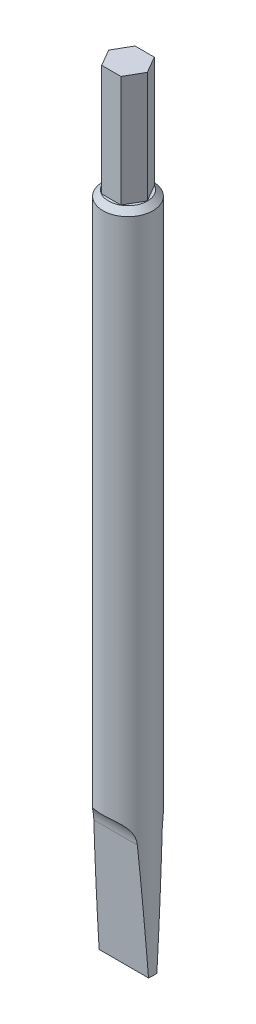
ISO-10303-21;
HEADER;
FILE_DESCRIPTION(('STEP AP214'),'2;1');
FILE_NAME('part.step','',(''),(''),'','','');
FILE_SCHEMA(('AUTOMOTIVE_DESIGN { 1 0 10303 214 1 1 1 1 }'));
ENDSEC;
DATA;
#1=APPLICATION_CONTEXT('core data for automotive mechanical design processes');
#2=APPLICATION_PROTOCOL_DEFINITION('international standard','automotive_design',2000,#1);
#3=PRODUCT_CONTEXT('',#1,'mechanical');
#4=PRODUCT('Part','Part','',(#3));
#5=PRODUCT_RELATED_PRODUCT_CATEGORY('part','',(#4));
#6=PRODUCT_DEFINITION_FORMATION('','',#4);
#7=PRODUCT_DEFINITION_CONTEXT('part definition',#1,'design');
#8=PRODUCT_DEFINITION('design','',#6,#7);
#9=PRODUCT_DEFINITION_SHAPE('','',#8);
#10=(LENGTH_UNIT() NAMED_UNIT(*) SI_UNIT(.MILLI.,.METRE.));
#11=(NAMED_UNIT(*) PLANE_ANGLE_UNIT() SI_UNIT($,.RADIAN.));
#12=(NAMED_UNIT(*) SI_UNIT($,.STERADIAN.) SOLID_ANGLE_UNIT());
#13=UNCERTAINTY_MEASURE_WITH_UNIT(LENGTH_MEASURE(1.E-05),#10,'distance_accuracy_value','');
#14=(GEOMETRIC_REPRESENTATION_CONTEXT(3) GLOBAL_UNCERTAINTY_ASSIGNED_CONTEXT((#13)) GLOBAL_UNIT_ASSIGNED_CONTEXT((#10,
#11,#12)) REPRESENTATION_CONTEXT('',''));
#15=CARTESIAN_POINT('',(0.,0.,0.));
#16=DIRECTION('',(0.,0.,1.));
#17=DIRECTION('',(1.,0.,0.));
#18=AXIS2_PLACEMENT_3D('',#15,#16,#17);
#19=CARTESIAN_POINT('',(0.,-120.,0.));
#20=DIRECTION('',(0.,1.,0.));
#21=DIRECTION('',(0.,0.,1.));
#22=AXIS2_PLACEMENT_3D('',#19,#20,#21);
#23=CYLINDRICAL_SURFACE('',#22,4.5);
#24=CARTESIAN_POINT('',(0.,-1.,0.));
#25=DIRECTION('',(0.,1.,0.));
#26=DIRECTION('',(0.,0.,1.));
#27=AXIS2_PLACEMENT_3D('',#24,#25,#26);
#28=CIRCLE('',#27,4.5);
#29=CARTESIAN_POINT('',(0.,-1.,4.5));
#30=VERTEX_POINT('',#29);
#31=EDGE_CURVE('E11',#30,#30,#28,.F.);
#32=ORIENTED_EDGE('',*,*,#31,.T.);
#33=EDGE_LOOP('',(#32));
#34=FACE_BOUND('',#33,.T.);
#35=CARTESIAN_POINT('',(0.,-103.394913822876,-4.5));
#36=CARTESIAN_POINT('',(-0.103069362665923,-103.394914042659,-4.49999959992725));
#37=CARTESIAN_POINT('',(-0.206146526435712,-103.39262561122,-4.4964547687701));
#38=CARTESIAN_POINT('',(-0.411646375812206,-103.383423224018,-4.48231641289706));
#39=CARTESIAN_POINT('',(-0.514068786670953,-103.37650744061,-4.471720103098));
#40=CARTESIAN_POINT('',(-0.717671951158927,-103.35789552238,-4.44359339520637));
#41=CARTESIAN_POINT('',(-0.818850709741653,-103.346192534688,-4.42605305791932));
#42=CARTESIAN_POINT('',(-1.01914825963944,-103.317776455429,-4.38426815019585));
#43=CARTESIAN_POINT('',(-1.11826612333105,-103.301061157844,-4.36002062815834));
#44=CARTESIAN_POINT('',(-1.31380152114607,-103.262306170916,-4.30514220860287));
#45=CARTESIAN_POINT('',(-1.41021536260285,-103.240259561821,-4.27450302221004));
#46=CARTESIAN_POINT('',(-1.59943155048247,-103.190529876519,-4.20736148164584));
#47=CARTESIAN_POINT('',(-1.69223560424762,-103.162849504525,-4.17086194222075));
#48=CARTESIAN_POINT('',(-1.87350490130666,-103.101518436916,-4.09264183349527));
#49=CARTESIAN_POINT('',(-1.96197270731233,-103.067871323284,-4.05092440102979));
#50=CARTESIAN_POINT('',(-2.13393666412592,-102.994279950018,-3.96303382328752));
#51=CARTESIAN_POINT('',(-2.21743303962978,-102.954335975283,-3.91686087963601));
#52=CARTESIAN_POINT('',(-2.37646391449524,-102.869174718413,-3.82239737029962));
#53=CARTESIAN_POINT('',(-2.45216008078263,-102.824146396459,-3.77420859180666));
#54=CARTESIAN_POINT('',(-2.59782907350368,-102.727787089095,-3.67546318239439));
#55=CARTESIAN_POINT('',(-2.66779991646167,-102.67645393472,-3.62490574033656));
#56=CARTESIAN_POINT('',(-2.80159661560524,-102.567531137201,-3.52252047999784));
#57=CARTESIAN_POINT('',(-2.8654256400608,-102.509944752788,-3.47069333419625));
#58=CARTESIAN_POINT('',(-2.98679509415646,-102.388614781465,-3.36681443417587));
#59=CARTESIAN_POINT('',(-3.04433320149471,-102.324868937029,-3.31476260433588));
#60=CARTESIAN_POINT('',(-3.15104312227083,-102.193974436802,-3.21343160285213));
#61=CARTESIAN_POINT('',(-3.20044482157964,-102.12703718801,-3.16412086929093));
#62=CARTESIAN_POINT('',(-3.29344984525705,-101.988055624931,-3.0671977760816));
#63=CARTESIAN_POINT('',(-3.33705110482004,-101.916009505936,-3.01958602561714));
#64=CARTESIAN_POINT('',(-3.4186310570823,-101.767266878692,-2.92690525303494));
#65=CARTESIAN_POINT('',(-3.45661023014175,-101.690570768537,-2.88183601388481));
#66=CARTESIAN_POINT('',(-3.52724775030431,-101.53297296321,-2.79493487388618));
#67=CARTESIAN_POINT('',(-3.55990413285861,-101.452069729729,-2.75310417130193));
#68=CARTESIAN_POINT('',(-3.6219367440911,-101.28186560832,-2.67102432402597));
#69=CARTESIAN_POINT('',(-3.65101984206152,-101.19234891593,-2.63100129171947));
#70=CARTESIAN_POINT('',(-3.70403304904539,-101.009771882005,-2.55582789107762));
#71=CARTESIAN_POINT('',(-3.72796092597583,-100.916710025943,-2.52067963573703));
#72=CARTESIAN_POINT('',(-3.77106708250034,-100.727657709272,-2.45572257370377));
#73=CARTESIAN_POINT('',(-3.79024470528684,-100.631666845735,-2.42591450554497));
#74=CARTESIAN_POINT('',(-3.82422567164936,-100.437339866016,-2.37198512656201));
#75=CARTESIAN_POINT('',(-3.83902866120985,-100.339003560726,-2.34786427600567));
#76=CARTESIAN_POINT('',(-3.86602211295916,-100.129353034472,-2.30317872247504));
#77=CARTESIAN_POINT('',(-3.87773008241694,-100.017825268037,-2.28332122951141));
#78=CARTESIAN_POINT('',(-3.89646653880564,-99.7932914657791,-2.25119824829118));
#79=CARTESIAN_POINT('',(-3.90349471231479,-99.6802853314612,-2.23893326853475));
#80=CARTESIAN_POINT('',(-3.91308600686779,-99.4534613843335,-2.22212780064841));
#81=CARTESIAN_POINT('',(-3.91564714529122,-99.3396432336147,-2.21759074245095));
#82=CARTESIAN_POINT('',(-3.91637773677079,-99.1119495796707,-2.21629990204797));
#83=CARTESIAN_POINT('',(-3.91454713883189,-98.998074075795,-2.21954621021972));
#84=CARTESIAN_POINT('',(-3.90616454068512,-98.7633117297481,-2.23426894804854));
#85=CARTESIAN_POINT('',(-3.89930286209515,-98.6424692075514,-2.24628494335067));
#86=CARTESIAN_POINT('',(-3.88027386542345,-98.402379038641,-2.2789980246609));
#87=CARTESIAN_POINT('',(-3.86810624825723,-98.2831314822228,-2.29969560002873));
#88=CARTESIAN_POINT('',(-3.83805987169652,-98.0471146765915,-2.34949827973738));
#89=CARTESIAN_POINT('',(-3.82018035463176,-97.9303457583566,-2.37860449941632));
#90=CARTESIAN_POINT('',(-3.77816410484998,-97.700240844913,-2.44479279662184));
#91=CARTESIAN_POINT('',(-3.75402763285338,-97.5869047068837,-2.48187454180608));
#92=CARTESIAN_POINT('',(-3.69934686071029,-97.3666734464334,-2.56264818514399));
#93=CARTESIAN_POINT('',(-3.66892797534512,-97.2596983870466,-2.60620662438003));
#94=CARTESIAN_POINT('',(-3.6007534422785,-97.0509444606988,-2.69961396127203));
#95=CARTESIAN_POINT('',(-3.56299779241061,-96.9491655952721,-2.74946286078548));
#96=CARTESIAN_POINT('',(-3.47953864440164,-96.7518689054786,-2.85434660668727));
#97=CARTESIAN_POINT('',(-3.43384376500395,-96.6563444446521,-2.90937580002357));
#98=CARTESIAN_POINT('',(-3.3339258219214,-96.4723551385887,-3.02335500686728));
#99=CARTESIAN_POINT('',(-3.2797039909588,-96.3838892756883,-3.08230445292271));
#100=CARTESIAN_POINT('',(-3.16847855957584,-96.2236046087848,-3.19631152006897));
#101=CARTESIAN_POINT('',(-3.11235065569653,-96.1510113485991,-3.25113633589682));
#102=CARTESIAN_POINT('',(-2.99288250161539,-96.0125695106199,-3.36143714975015));
#103=CARTESIAN_POINT('',(-2.92954292203082,-95.9467203067733,-3.41691308679795));
#104=CARTESIAN_POINT('',(-2.79578912411174,-95.8220714125837,-3.52719038039944));
#105=CARTESIAN_POINT('',(-2.72537706555112,-95.763269582091,-3.58199193718975));
#106=CARTESIAN_POINT('',(-2.57778204696871,-95.652802975382,-3.68963122609969));
#107=CARTESIAN_POINT('',(-2.50059939899424,-95.601137870526,-3.74246904856555));
#108=CARTESIAN_POINT('',(-2.34717040047751,-95.5091957964646,-3.84035365857383));
#109=CARTESIAN_POINT('',(-2.27146003882035,-95.4683131853461,-3.88567430027106));
#110=CARTESIAN_POINT('',(-2.11529480833383,-95.3922359565951,-3.972848583273));
#111=CARTESIAN_POINT('',(-2.03483843928944,-95.3570431508055,-4.0147011181452));
#112=CARTESIAN_POINT('',(-1.86976491901818,-95.2921376723537,-4.09418737623395));
#113=CARTESIAN_POINT('',(-1.78514852365474,-95.2624240087761,-4.13182186181072));
#114=CARTESIAN_POINT('',(-1.61229273576319,-95.2081830224124,-4.20228834208165));
#115=CARTESIAN_POINT('',(-1.5240519687402,-95.1836576893278,-4.23511849285271));
#116=CARTESIAN_POINT('',(-1.34297373485952,-95.1391247663095,-4.29601076944073));
#117=CARTESIAN_POINT('',(-1.25008227473877,-95.119205847982,-4.32397708815631));
#118=CARTESIAN_POINT('',(-1.06180899916159,-95.0841653046433,-4.37402031006423));
#119=CARTESIAN_POINT('',(-0.966426342269643,-95.0690453238235,-4.39609519434713));
#120=CARTESIAN_POINT('',(-0.773829999084719,-95.0433649599258,-4.43405247530582));
#121=CARTESIAN_POINT('',(-0.67661623380171,-95.0328047740197,-4.44993460419531));
#122=CARTESIAN_POINT('',(-0.480984528317148,-95.0160579191887,-4.47530827628885));
#123=CARTESIAN_POINT('',(-0.382566543780501,-95.009871411783,-4.48479958348028));
#124=CARTESIAN_POINT('',(-0.179786485951478,-95.0015365778041,-4.49761588849471));
#125=CARTESIAN_POINT('',(-0.0753915311064896,-94.9996254651257,-4.50057852937734));
#126=CARTESIAN_POINT('',(0.133298519520404,-95.0004951178538,-4.49923517876634));
#127=CARTESIAN_POINT('',(0.237593636135419,-95.0032744409985,-4.49493142161667));
#128=CARTESIAN_POINT('',(0.445460657929832,-95.0135840572233,-4.47911096934641));
#129=CARTESIAN_POINT('',(0.549032116626808,-95.021117059519,-4.46759016111325));
#130=CARTESIAN_POINT('',(0.754625845668836,-95.0410874084281,-4.43749130505876));
#131=CARTESIAN_POINT('',(0.856648700766109,-95.0535228534982,-4.41891599361709));
#132=CARTESIAN_POINT('',(1.05994525916555,-95.0837602785431,-4.37464243756219));
#133=CARTESIAN_POINT('',(1.16118558801717,-95.1016388796568,-4.34884294710629));
#134=CARTESIAN_POINT('',(1.36053785732147,-95.143007132598,-4.29065419495021));
#135=CARTESIAN_POINT('',(1.45865101676466,-95.1664945669813,-4.2582675382252));
#136=CARTESIAN_POINT('',(1.65098719675716,-95.2194423919957,-4.18745032243508));
#137=CARTESIAN_POINT('',(1.74521105913875,-95.2489014818249,-4.14902108003093));
#138=CARTESIAN_POINT('',(1.92901767855518,-95.3141635141516,-4.06681991059837));
#139=CARTESIAN_POINT('',(2.01860068178547,-95.3499661196823,-4.02304826739616));
#140=CARTESIAN_POINT('',(2.18891848545426,-95.4266740694932,-3.93288020236327));
#141=CARTESIAN_POINT('',(2.26986393495041,-95.4673177649192,-3.88665900252031));
#142=CARTESIAN_POINT('',(2.42626213602189,-95.5549803520153,-3.79099688495645));
#143=CARTESIAN_POINT('',(2.50171301535398,-95.6020014012547,-3.74155488053635));
#144=CARTESIAN_POINT('',(2.64656035017944,-95.7024681214229,-3.64053705577675));
#145=CARTESIAN_POINT('',(2.7159614560591,-95.7559087811697,-3.58896292015322));
#146=CARTESIAN_POINT('',(2.84846407594613,-95.8692271728094,-3.48473261347847));
#147=CARTESIAN_POINT('',(2.91156332549746,-95.9291072026348,-3.43207606161792));
#148=CARTESIAN_POINT('',(3.02840560019249,-96.0520982713688,-3.32934266894438));
#149=CARTESIAN_POINT('',(3.08245105089512,-96.1149197416817,-3.27926236791103));
#150=CARTESIAN_POINT('',(3.18465150256467,-96.2459623576306,-3.18010490670167));
#151=CARTESIAN_POINT('',(3.23280441410219,-96.3141854045644,-3.13102810746448));
#152=CARTESIAN_POINT('',(3.32330769017291,-96.4556291794089,-3.03479657993719));
#153=CARTESIAN_POINT('',(3.36565874341878,-96.5288493125892,-2.98764162398132));
#154=CARTESIAN_POINT('',(3.44480286097594,-96.6798778646987,-2.89603178121556));
#155=CARTESIAN_POINT('',(3.48159386714152,-96.7576879679373,-2.85157789787664));
#156=CARTESIAN_POINT('',(3.55117195899449,-96.9203591953555,-2.76448915105963));
#157=CARTESIAN_POINT('',(3.58375903483153,-97.0053749690322,-2.7219835871284));
#158=CARTESIAN_POINT('',(3.64365535207883,-97.1792604539376,-2.64126927684474));
#159=CARTESIAN_POINT('',(3.67096233171437,-97.2681317968632,-2.60306237477839));
#160=CARTESIAN_POINT('',(3.72068770710745,-97.4491359280304,-2.53147847510344));
#161=CARTESIAN_POINT('',(3.74310552182694,-97.5412691024041,-2.49810205171688));
#162=CARTESIAN_POINT('',(3.78343773102366,-97.7282323184802,-2.43658605030679));
#163=CARTESIAN_POINT('',(3.80135173551187,-97.8230625929362,-2.40844692584048));
#164=CARTESIAN_POINT('',(3.83477673953591,-98.0254867373075,-2.35490834516224));
#165=CARTESIAN_POINT('',(3.84980292215984,-98.1333323737528,-2.33015598307192));
#166=CARTESIAN_POINT('',(3.87512687895666,-98.350964521976,-2.28779373167278));
#167=CARTESIAN_POINT('',(3.88542435170483,-98.4607511570169,-2.27018429768784));
#168=CARTESIAN_POINT('',(3.90158383710491,-98.6816216375678,-2.24229877350844));
#169=CARTESIAN_POINT('',(3.90744396683313,-98.7927060134766,-2.23202579654068));
#170=CARTESIAN_POINT('',(3.91489365328982,-99.0154551962105,-2.21893299425261));
#171=CARTESIAN_POINT('',(3.91648310020706,-99.1271200178865,-2.21611336057868));
#172=CARTESIAN_POINT('',(3.91539728764432,-99.359443697774,-2.21803256126057));
#173=CARTESIAN_POINT('',(3.9123651171464,-99.4800963396136,-2.22340397701381));
#174=CARTESIAN_POINT('',(3.90125936585219,-99.7204736261698,-2.24283296683402));
#175=CARTESIAN_POINT('',(3.89318547551112,-99.8401982134499,-2.25689107423434));
#176=CARTESIAN_POINT('',(3.87171813877961,-100.077894459356,-2.29352339709322));
#177=CARTESIAN_POINT('',(3.85832316253481,-100.195865603725,-2.3161000616107));
#178=CARTESIAN_POINT('',(3.82578291934211,-100.429130513122,-2.36946433582886));
#179=CARTESIAN_POINT('',(3.80663778801869,-100.54442434123,-2.40025175186696));
#180=CARTESIAN_POINT('',(3.76204969756655,-100.771324533996,-2.46955006626094));
#181=CARTESIAN_POINT('',(3.73661164235411,-100.882933693623,-2.50805494617879));
#182=CARTESIAN_POINT('',(3.67876997677129,-101.10159785216,-2.59215244599267));
#183=CARTESIAN_POINT('',(3.64636625414008,-101.208652777638,-2.63774518011545));
#184=CARTESIAN_POINT('',(3.57392775310543,-101.417121358701,-2.73508968205905));
#185=CARTESIAN_POINT('',(3.53389992732547,-101.518540046106,-2.78683582239652));
#186=CARTESIAN_POINT('',(3.4455351808607,-101.714850708547,-2.89537198598166));
#187=CARTESIAN_POINT('',(3.39719938041741,-101.80974356111,-2.9521613287091));
#188=CARTESIAN_POINT('',(3.29650209378132,-101.983775221334,-3.06401792825744));
#189=CARTESIAN_POINT('',(3.24490917812633,-102.063561604967,-3.11877030223412));
#190=CARTESIAN_POINT('',(3.13418199914556,-102.216403021385,-3.23002452467416));
#191=CARTESIAN_POINT('',(3.07504820853484,-102.289458475617,-3.28652626330706));
#192=CARTESIAN_POINT('',(2.94923741426076,-102.428344036006,-3.39987656193094));
#193=CARTESIAN_POINT('',(2.8825653978878,-102.494178863178,-3.45672486934677));
#194=CARTESIAN_POINT('',(2.74182760560054,-102.618409132379,-3.56938382220597));
#195=CARTESIAN_POINT('',(2.66776238592768,-102.676805133331,-3.62519454533972));
#196=CARTESIAN_POINT('',(2.52073395305747,-102.780391407808,-3.72868896674217));
#197=CARTESIAN_POINT('',(2.44846069234197,-102.826323719211,-3.77661337954485));
#198=CARTESIAN_POINT('',(2.29869197722838,-102.912266607234,-3.86959754692028));
#199=CARTESIAN_POINT('',(2.22119473433098,-102.952275140632,-3.91465631003366));
#200=CARTESIAN_POINT('',(2.0614928938653,-103.026537112772,-4.00106138832015));
#201=CARTESIAN_POINT('',(1.97928722568457,-103.060789235588,-4.04240685362277));
#202=CARTESIAN_POINT('',(1.81072524154588,-103.123790491803,-4.1206688840926));
#203=CARTESIAN_POINT('',(1.72436743323571,-103.152537627834,-4.15758383993657));
#204=CARTESIAN_POINT('',(1.54817364969426,-103.204791578248,-4.22635764730017));
#205=CARTESIAN_POINT('',(1.45833913474396,-103.228300565307,-4.25821859353252));
#206=CARTESIAN_POINT('',(1.27573849578302,-103.270397304679,-4.3164428873989));
#207=CARTESIAN_POINT('',(1.18297107780909,-103.288982849931,-4.34280376836452));
#208=CARTESIAN_POINT('',(0.995331853000642,-103.321462475154,-4.38960691636663));
#209=CARTESIAN_POINT('',(0.900464034630363,-103.335364749555,-4.41005951223732));
#210=CARTESIAN_POINT('',(0.709077330364519,-103.358749809845,-4.44484740959923));
#211=CARTESIAN_POINT('',(0.612558468930338,-103.368232661153,-4.4591828016397));
#212=CARTESIAN_POINT('',(0.430138417632378,-103.382060878757,-4.48021987851915));
#213=CARTESIAN_POINT('',(0.34435431572488,-103.38688649476,-4.48763162485991));
#214=CARTESIAN_POINT('',(0.172381964724902,-103.393312896669,-4.49752188615395));
#215=CARTESIAN_POINT('',(0.0861937101970529,-103.394913639079,-4.50000033456842));
#216=CARTESIAN_POINT('',(0.,-103.394913822876,-4.5));
#217=B_SPLINE_CURVE_WITH_KNOTS('',3,(#35,#36,#37,#38,#39,#40,#41,#42,#43,#44,#45,#46,#47,#48,
#49,#50,#51,#52,#53,#54,#55,#56,#57,#58,#59,#60,#61,#62,#63,#64,#65,#66,#67,#68,#69,#70,#71,#72,
#73,#74,#75,#76,#77,#78,#79,#80,#81,#82,#83,#84,#85,#86,#87,#88,#89,#90,#91,#92,#93,#94,#95,#96,
#97,#98,#99,#100,#101,#102,#103,#104,#105,#106,#107,#108,#109,#110,#111,#112,#113,#114,#115,
#116,#117,#118,#119,#120,#121,#122,#123,#124,#125,#126,#127,#128,#129,#130,#131,#132,#133,#134,
#135,#136,#137,#138,#139,#140,#141,#142,#143,#144,#145,#146,#147,#148,#149,#150,#151,#152,#153,
#154,#155,#156,#157,#158,#159,#160,#161,#162,#163,#164,#165,#166,#167,#168,#169,#170,#171,#172,
#173,#174,#175,#176,#177,#178,#179,#180,#181,#182,#183,#184,#185,#186,#187,#188,#189,#190,#191,
#192,#193,#194,#195,#196,#197,#198,#199,#200,#201,#202,#203,#204,#205,#206,#207,#208,#209,#210,
#211,#212,#213,#214,#215,#216),.UNSPECIFIED.,.T.,.F.,(4,2,2,2,2,2,2,2,2,2,2,2,2,2,2,2,2,2,2,2,2,
2,2,2,2,2,2,2,2,2,2,2,2,2,2,2,2,2,2,2,2,2,2,2,2,2,2,2,2,2,2,2,2,2,2,2,2,2,2,2,2,2,2,2,2,2,2,2,2,
2,2,2,2,2,2,2,2,2,2,2,2,2,2,2,2,2,2,2,2,2,4),(0.,0.309135188173823,0.618392546272531,
0.928094163427287,1.23793228701997,1.54817474269632,1.85826863124843,2.1681769890218,
2.47807132908082,2.77887922218733,3.07979088952104,3.38054648928678,3.68141274123979,
3.97121245448042,4.26111505440179,4.55099287026077,4.84097743386243,5.14749365790799,
5.45414233035835,5.76083337883225,6.06754923936998,6.4088342372236,6.75014208978927,
7.09160138774854,7.43306465061265,7.79752512639501,8.16200614869649,8.5265355386486,
8.89104974150324,9.24888991183937,9.60673018784064,9.96418439614746,10.3215869755264,
10.6418214865778,10.9620262431482,11.2821335120663,11.602226035416,11.893632150727,
12.1851308784472,12.4765768361295,12.7681343602163,13.0649078374311,13.3617828844209,
13.6586707674181,13.9555696138638,14.2685711441521,14.5814764471602,14.8945602423359,
15.2075227188972,15.5251120490117,15.842576027905,16.1599709279819,16.4773489731259,
16.7820217341375,17.0867978295394,17.3913375424989,17.6959862954218,17.9861303984156,
18.2763770870127,18.5665892918134,18.856908661828,19.1580344208093,19.4592888852297,
19.7605791318424,20.0618954584726,20.396533300421,20.7311924704109,21.0659935688243,
21.4008032758306,21.7628096678089,22.1248382879575,22.4869710696219,22.84909531061,
23.2109382414062,23.5727870042114,23.9343073537812,24.2957789943862,24.6243013724941,
24.9528031666232,25.2810888818575,25.6093499164933,25.903392228367,26.1975357258831,
26.4917463740058,26.7860635688321,27.0802584587959,27.3745850069726,27.6683938572329,
27.9621983582687,28.2207150382292,28.4792352049594),.UNSPECIFIED.);
#218=CARTESIAN_POINT('',(-3.90913794443017,-98.8486745427176,-2.22904475760722));
#219=VERTEX_POINT('',#218);
#220=CARTESIAN_POINT('',(3.90913794443017,-98.8486745427176,-2.22904475760722));
#221=VERTEX_POINT('',#220);
#222=EDGE_CURVE('E132',#219,#221,#217,.T.);
#223=ORIENTED_EDGE('',*,*,#222,.F.);
#224=CARTESIAN_POINT('',(0.,-130.725499692535,0.));
#225=DIRECTION('',(0.,-0.0697564737441183,-0.997564050259825));
#226=DIRECTION('',(0.,0.997564050259825,-0.0697564737441183));
#227=AXIS2_PLACEMENT_3D('',#224,#225,#226);
#228=ELLIPSE('',#227,64.510141617923,4.5);
#229=CARTESIAN_POINT('',(-4.43705983732471,-120.,-0.750000000000003));
#230=VERTEX_POINT('',#229);
#231=EDGE_CURVE('E148',#219,#230,#228,.F.);
#232=ORIENTED_EDGE('',*,*,#231,.T.);
#233=CARTESIAN_POINT('',(0.,-120.,0.));
#234=DIRECTION('',(0.,1.,0.));
#235=DIRECTION('',(0.,0.,1.));
#236=AXIS2_PLACEMENT_3D('',#233,#234,#235);
#237=CIRCLE('',#236,4.5);
#238=CARTESIAN_POINT('',(-4.43705983732471,-120.,0.749999999999999));
#239=VERTEX_POINT('',#238);
#240=EDGE_CURVE('E143',#230,#239,#237,.T.);
#241=ORIENTED_EDGE('',*,*,#240,.T.);
#242=CARTESIAN_POINT('',(0.,-130.725499692535,0.));
#243=DIRECTION('',(0.,0.0697564737441183,-0.997564050259825));
#244=DIRECTION('',(0.,0.997564050259825,0.0697564737441183));
#245=AXIS2_PLACEMENT_3D('',#242,#243,#244);
#246=ELLIPSE('',#245,64.510141617923,4.5);
#247=CARTESIAN_POINT('',(-3.90913794443017,-98.8486745427176,2.22904475760722));
#248=VERTEX_POINT('',#247);
#249=EDGE_CURVE('E62',#248,#239,#246,.F.);
#250=ORIENTED_EDGE('',*,*,#249,.F.);
#251=CARTESIAN_POINT('',(0.,-103.394913822876,4.5));
#252=CARTESIAN_POINT('',(-0.103069362665923,-103.394914042659,4.49999959992725));
#253=CARTESIAN_POINT('',(-0.206146526435712,-103.39262561122,4.4964547687701));
#254=CARTESIAN_POINT('',(-0.411646375812205,-103.383423224018,4.48231641289706));
#255=CARTESIAN_POINT('',(-0.514068786670951,-103.37650744061,4.471720103098));
#256=CARTESIAN_POINT('',(-0.717671951158924,-103.35789552238,4.44359339520637));
#257=CARTESIAN_POINT('',(-0.818850709741651,-103.346192534688,4.42605305791933));
#258=CARTESIAN_POINT('',(-1.01914825963943,-103.317776455429,4.38426815019585));
#259=CARTESIAN_POINT('',(-1.11826612333105,-103.301061157844,4.36002062815834));
#260=CARTESIAN_POINT('',(-1.31380152114607,-103.262306170916,4.30514220860287));
#261=CARTESIAN_POINT('',(-1.41021536260285,-103.240259561821,4.27450302221004));
#262=CARTESIAN_POINT('',(-1.59943155048248,-103.190529876519,4.20736148164584));
#263=CARTESIAN_POINT('',(-1.69223560424763,-103.162849504525,4.17086194222075));
#264=CARTESIAN_POINT('',(-1.87350490130667,-103.101518436916,4.09264183349527));
#265=CARTESIAN_POINT('',(-1.96197270731234,-103.067871323284,4.05092440102978));
#266=CARTESIAN_POINT('',(-2.13393666412593,-102.994279950018,3.96303382328751));
#267=CARTESIAN_POINT('',(-2.21743303962979,-102.954335975283,3.91686087963601));
#268=CARTESIAN_POINT('',(-2.37646391449524,-102.869174718413,3.82239737029962));
#269=CARTESIAN_POINT('',(-2.45216008078264,-102.824146396459,3.77420859180666));
#270=CARTESIAN_POINT('',(-2.59782907350368,-102.727787089095,3.67546318239439));
#271=CARTESIAN_POINT('',(-2.66779991646167,-102.67645393472,3.62490574033656));
#272=CARTESIAN_POINT('',(-2.80159661560525,-102.567531137201,3.52252047999784));
#273=CARTESIAN_POINT('',(-2.86542564006081,-102.509944752788,3.47069333419624));
#274=CARTESIAN_POINT('',(-2.98679509415646,-102.388614781465,3.36681443417587));
#275=CARTESIAN_POINT('',(-3.04433320149472,-102.324868937029,3.31476260433588));
#276=CARTESIAN_POINT('',(-3.15104312227083,-102.193974436802,3.21343160285213));
#277=CARTESIAN_POINT('',(-3.20044482157964,-102.12703718801,3.16412086929093));
#278=CARTESIAN_POINT('',(-3.29344984525705,-101.988055624931,3.0671977760816));
#279=CARTESIAN_POINT('',(-3.33705110482005,-101.916009505936,3.01958602561713));
#280=CARTESIAN_POINT('',(-3.41863105708231,-101.767266878692,2.92690525303494));
#281=CARTESIAN_POINT('',(-3.45661023014175,-101.690570768537,2.8818360138848));
#282=CARTESIAN_POINT('',(-3.52724775030431,-101.53297296321,2.79493487388617));
#283=CARTESIAN_POINT('',(-3.55990413285861,-101.452069729729,2.75310417130193));
#284=CARTESIAN_POINT('',(-3.62193674409111,-101.28186560832,2.67102432402596));
#285=CARTESIAN_POINT('',(-3.65101984206153,-101.19234891593,2.63100129171946));
#286=CARTESIAN_POINT('',(-3.7040330490454,-101.009771882005,2.55582789107761));
#287=CARTESIAN_POINT('',(-3.72796092597584,-100.916710025943,2.52067963573702));
#288=CARTESIAN_POINT('',(-3.77106708250035,-100.727657709272,2.45572257370377));
#289=CARTESIAN_POINT('',(-3.79024470528685,-100.631666845735,2.42591450554496));
#290=CARTESIAN_POINT('',(-3.82422567164936,-100.437339866016,2.371985126562));
#291=CARTESIAN_POINT('',(-3.83902866120985,-100.339003560726,2.34786427600567));
#292=CARTESIAN_POINT('',(-3.86602211295916,-100.129353034472,2.30317872247504));
#293=CARTESIAN_POINT('',(-3.87773008241695,-100.017825268037,2.2833212295114));
#294=CARTESIAN_POINT('',(-3.89646653880564,-99.7932914657791,2.25119824829117));
#295=CARTESIAN_POINT('',(-3.90349471231479,-99.6802853314612,2.23893326853474));
#296=CARTESIAN_POINT('',(-3.91308600686779,-99.4534613843335,2.2221278006484));
#297=CARTESIAN_POINT('',(-3.91564714529122,-99.3396432336147,2.21759074245094));
#298=CARTESIAN_POINT('',(-3.9163777367708,-99.1119495796707,2.21629990204796));
#299=CARTESIAN_POINT('',(-3.9145471388319,-98.998074075795,2.21954621021972));
#300=CARTESIAN_POINT('',(-3.90616454068512,-98.7633117297481,2.23426894804853));
#301=CARTESIAN_POINT('',(-3.89930286209515,-98.6424692075514,2.24628494335066));
#302=CARTESIAN_POINT('',(-3.88027386542346,-98.402379038641,2.2789980246609));
#303=CARTESIAN_POINT('',(-3.86810624825724,-98.2831314822228,2.29969560002872));
#304=CARTESIAN_POINT('',(-3.83805987169653,-98.0471146765915,2.34949827973737));
#305=CARTESIAN_POINT('',(-3.82018035463177,-97.9303457583566,2.37860449941632));
#306=CARTESIAN_POINT('',(-3.77816410484999,-97.700240844913,2.44479279662183));
#307=CARTESIAN_POINT('',(-3.75402763285339,-97.5869047068837,2.48187454180607));
#308=CARTESIAN_POINT('',(-3.6993468607103,-97.3666734464334,2.56264818514399));
#309=CARTESIAN_POINT('',(-3.66892797534513,-97.2596983870466,2.60620662438002));
#310=CARTESIAN_POINT('',(-3.60075344227851,-97.0509444606988,2.69961396127203));
#311=CARTESIAN_POINT('',(-3.56299779241062,-96.9491655952721,2.74946286078547));
#312=CARTESIAN_POINT('',(-3.47953864440165,-96.7518689054786,2.85434660668726));
#313=CARTESIAN_POINT('',(-3.43384376500395,-96.6563444446521,2.90937580002356));
#314=CARTESIAN_POINT('',(-3.3339258219214,-96.4723551385887,3.02335500686727));
#315=CARTESIAN_POINT('',(-3.27970399095881,-96.3838892756883,3.0823044529227));
#316=CARTESIAN_POINT('',(-3.16847855957585,-96.2236046087848,3.19631152006896));
#317=CARTESIAN_POINT('',(-3.11235065569654,-96.1510113485991,3.25113633589682));
#318=CARTESIAN_POINT('',(-2.99288250161539,-96.0125695106199,3.36143714975015));
#319=CARTESIAN_POINT('',(-2.92954292203082,-95.9467203067733,3.41691308679795));
#320=CARTESIAN_POINT('',(-2.79578912411174,-95.8220714125837,3.52719038039944));
#321=CARTESIAN_POINT('',(-2.72537706555113,-95.763269582091,3.58199193718975));
#322=CARTESIAN_POINT('',(-2.57778204696872,-95.652802975382,3.68963122609968));
#323=CARTESIAN_POINT('',(-2.50059939899425,-95.601137870526,3.74246904856555));
#324=CARTESIAN_POINT('',(-2.34717040047752,-95.5091957964646,3.84035365857382));
#325=CARTESIAN_POINT('',(-2.27146003882036,-95.4683131853461,3.88567430027106));
#326=CARTESIAN_POINT('',(-2.11529480833384,-95.3922359565951,3.97284858327299));
#327=CARTESIAN_POINT('',(-2.03483843928945,-95.3570431508055,4.01470111814519));
#328=CARTESIAN_POINT('',(-1.86976491901819,-95.2921376723537,4.09418737623394));
#329=CARTESIAN_POINT('',(-1.78514852365475,-95.2624240087761,4.13182186181072));
#330=CARTESIAN_POINT('',(-1.6122927357632,-95.2081830224124,4.20228834208165));
#331=CARTESIAN_POINT('',(-1.52405196874021,-95.1836576893278,4.23511849285271));
#332=CARTESIAN_POINT('',(-1.34297373485953,-95.1391247663095,4.29601076944073));
#333=CARTESIAN_POINT('',(-1.25008227473878,-95.119205847982,4.32397708815631));
#334=CARTESIAN_POINT('',(-1.0618089991616,-95.0841653046433,4.37402031006423));
#335=CARTESIAN_POINT('',(-0.966426342269648,-95.0690453238235,4.39609519434713));
#336=CARTESIAN_POINT('',(-0.773829999084723,-95.0433649599258,4.43405247530582));
#337=CARTESIAN_POINT('',(-0.676616233801715,-95.0328047740197,4.44993460419531));
#338=CARTESIAN_POINT('',(-0.480984528317152,-95.0160579191887,4.47530827628885));
#339=CARTESIAN_POINT('',(-0.382566543780504,-95.009871411783,4.48479958348028));
#340=CARTESIAN_POINT('',(-0.179786485951481,-95.0015365778041,4.49761588849471));
#341=CARTESIAN_POINT('',(-0.0753915311064939,-94.9996254651257,4.50057852937734));
#342=CARTESIAN_POINT('',(0.133298519520399,-95.0004951178538,4.49923517876634));
#343=CARTESIAN_POINT('',(0.237593636135414,-95.0032744409985,4.49493142161667));
#344=CARTESIAN_POINT('',(0.445460657929827,-95.0135840572233,4.47911096934641));
#345=CARTESIAN_POINT('',(0.549032116626802,-95.021117059519,4.46759016111325));
#346=CARTESIAN_POINT('',(0.75462584566883,-95.0410874084281,4.43749130505876));
#347=CARTESIAN_POINT('',(0.856648700766104,-95.0535228534981,4.41891599361709));
#348=CARTESIAN_POINT('',(1.05994525916554,-95.0837602785431,4.37464243756219));
#349=CARTESIAN_POINT('',(1.16118558801716,-95.1016388796568,4.34884294710629));
#350=CARTESIAN_POINT('',(1.36053785732146,-95.143007132598,4.29065419495021));
#351=CARTESIAN_POINT('',(1.45865101676466,-95.1664945669813,4.2582675382252));
#352=CARTESIAN_POINT('',(1.65098719675716,-95.2194423919957,4.18745032243508));
#353=CARTESIAN_POINT('',(1.74521105913875,-95.2489014818249,4.14902108003093));
#354=CARTESIAN_POINT('',(1.92901767855518,-95.3141635141516,4.06681991059837));
#355=CARTESIAN_POINT('',(2.01860068178547,-95.3499661196823,4.02304826739616));
#356=CARTESIAN_POINT('',(2.18891848545425,-95.4266740694932,3.93288020236327));
#357=CARTESIAN_POINT('',(2.26986393495041,-95.4673177649192,3.88665900252031));
#358=CARTESIAN_POINT('',(2.4262621360219,-95.5549803520153,3.79099688495645));
#359=CARTESIAN_POINT('',(2.50171301535399,-95.6020014012547,3.74155488053635));
#360=CARTESIAN_POINT('',(2.64656035017944,-95.7024681214229,3.64053705577675));
#361=CARTESIAN_POINT('',(2.7159614560591,-95.7559087811697,3.58896292015322));
#362=CARTESIAN_POINT('',(2.84846407594613,-95.8692271728094,3.48473261347847));
#363=CARTESIAN_POINT('',(2.91156332549746,-95.9291072026347,3.43207606161792));
#364=CARTESIAN_POINT('',(3.02840560019249,-96.0520982713688,3.32934266894438));
#365=CARTESIAN_POINT('',(3.08245105089513,-96.1149197416817,3.27926236791102));
#366=CARTESIAN_POINT('',(3.18465150256468,-96.2459623576306,3.18010490670166));
#367=CARTESIAN_POINT('',(3.23280441410219,-96.3141854045644,3.13102810746447));
#368=CARTESIAN_POINT('',(3.32330769017292,-96.4556291794089,3.03479657993718));
#369=CARTESIAN_POINT('',(3.36565874341879,-96.5288493125892,2.98764162398131));
#370=CARTESIAN_POINT('',(3.44480286097594,-96.6798778646987,2.89603178121556));
#371=CARTESIAN_POINT('',(3.48159386714152,-96.7576879679373,2.85157789787664));
#372=CARTESIAN_POINT('',(3.55117195899449,-96.9203591953555,2.76448915105963));
#373=CARTESIAN_POINT('',(3.58375903483153,-97.0053749690322,2.7219835871284));
#374=CARTESIAN_POINT('',(3.64365535207883,-97.1792604539376,2.64126927684473));
#375=CARTESIAN_POINT('',(3.67096233171438,-97.2681317968632,2.60306237477838));
#376=CARTESIAN_POINT('',(3.72068770710746,-97.4491359280304,2.53147847510343));
#377=CARTESIAN_POINT('',(3.74310552182694,-97.5412691024041,2.49810205171687));
#378=CARTESIAN_POINT('',(3.78343773102366,-97.7282323184802,2.43658605030678));
#379=CARTESIAN_POINT('',(3.80135173551188,-97.8230625929362,2.40844692584047));
#380=CARTESIAN_POINT('',(3.83477673953591,-98.0254867373075,2.35490834516223));
#381=CARTESIAN_POINT('',(3.84980292215984,-98.1333323737528,2.33015598307192));
#382=CARTESIAN_POINT('',(3.87512687895667,-98.350964521976,2.28779373167278));
#383=CARTESIAN_POINT('',(3.88542435170484,-98.4607511570169,2.27018429768784));
#384=CARTESIAN_POINT('',(3.90158383710492,-98.6816216375678,2.24229877350844));
#385=CARTESIAN_POINT('',(3.90744396683314,-98.7927060134766,2.23202579654068));
#386=CARTESIAN_POINT('',(3.91489365328983,-99.0154551962105,2.2189329942526));
#387=CARTESIAN_POINT('',(3.91648310020707,-99.1271200178865,2.21611336057867));
#388=CARTESIAN_POINT('',(3.91539728764433,-99.359443697774,2.21803256126056));
#389=CARTESIAN_POINT('',(3.9123651171464,-99.4800963396136,2.2234039770138));
#390=CARTESIAN_POINT('',(3.90125936585219,-99.7204736261697,2.24283296683402));
#391=CARTESIAN_POINT('',(3.89318547551113,-99.8401982134499,2.25689107423433));
#392=CARTESIAN_POINT('',(3.87171813877961,-100.077894459356,2.29352339709321));
#393=CARTESIAN_POINT('',(3.85832316253482,-100.195865603725,2.31610006161069));
#394=CARTESIAN_POINT('',(3.82578291934212,-100.429130513122,2.36946433582886));
#395=CARTESIAN_POINT('',(3.80663778801869,-100.54442434123,2.40025175186695));
#396=CARTESIAN_POINT('',(3.76204969756656,-100.771324533996,2.46955006626093));
#397=CARTESIAN_POINT('',(3.73661164235412,-100.882933693623,2.50805494617878));
#398=CARTESIAN_POINT('',(3.6787699767713,-101.10159785216,2.59215244599266));
#399=CARTESIAN_POINT('',(3.64636625414009,-101.208652777638,2.63774518011544));
#400=CARTESIAN_POINT('',(3.57392775310544,-101.417121358701,2.73508968205904));
#401=CARTESIAN_POINT('',(3.53389992732547,-101.518540046106,2.78683582239651));
#402=CARTESIAN_POINT('',(3.4455351808607,-101.714850708547,2.89537198598165));
#403=CARTESIAN_POINT('',(3.39719938041741,-101.80974356111,2.95216132870909));
#404=CARTESIAN_POINT('',(3.29650209378133,-101.983775221334,3.06401792825743));
#405=CARTESIAN_POINT('',(3.24490917812634,-102.063561604967,3.11877030223411));
#406=CARTESIAN_POINT('',(3.13418199914556,-102.216403021385,3.23002452467415));
#407=CARTESIAN_POINT('',(3.07504820853485,-102.289458475617,3.28652626330706));
#408=CARTESIAN_POINT('',(2.94923741426076,-102.428344036006,3.39987656193094));
#409=CARTESIAN_POINT('',(2.88256539788781,-102.494178863178,3.45672486934676));
#410=CARTESIAN_POINT('',(2.74182760560055,-102.618409132379,3.56938382220596));
#411=CARTESIAN_POINT('',(2.66776238592769,-102.676805133331,3.62519454533971));
#412=CARTESIAN_POINT('',(2.52073395305748,-102.780391407808,3.72868896674217));
#413=CARTESIAN_POINT('',(2.44846069234198,-102.826323719211,3.77661337954484));
#414=CARTESIAN_POINT('',(2.29869197722839,-102.912266607234,3.86959754692028));
#415=CARTESIAN_POINT('',(2.22119473433099,-102.952275140632,3.91465631003365));
#416=CARTESIAN_POINT('',(2.06149289386531,-103.026537112772,4.00106138832014));
#417=CARTESIAN_POINT('',(1.97928722568458,-103.060789235588,4.04240685362276));
#418=CARTESIAN_POINT('',(1.81072524154588,-103.123790491803,4.1206688840926));
#419=CARTESIAN_POINT('',(1.72436743323572,-103.152537627834,4.15758383993656));
#420=CARTESIAN_POINT('',(1.54817364969426,-103.204791578248,4.22635764730017));
#421=CARTESIAN_POINT('',(1.45833913474397,-103.228300565307,4.25821859353252));
#422=CARTESIAN_POINT('',(1.27573849578302,-103.270397304679,4.3164428873989));
#423=CARTESIAN_POINT('',(1.18297107780909,-103.288982849931,4.34280376836452));
#424=CARTESIAN_POINT('',(0.995331853000643,-103.321462475154,4.38960691636663));
#425=CARTESIAN_POINT('',(0.900464034630363,-103.335364749555,4.41005951223732));
#426=CARTESIAN_POINT('',(0.709077330364519,-103.358749809845,4.44484740959923));
#427=CARTESIAN_POINT('',(0.612558468930339,-103.368232661153,4.4591828016397));
#428=CARTESIAN_POINT('',(0.43013841763238,-103.382060878757,4.48021987851915));
#429=CARTESIAN_POINT('',(0.344354315724881,-103.38688649476,4.48763162485991));
#430=CARTESIAN_POINT('',(0.172381964724903,-103.393312896669,4.49752188615395));
#431=CARTESIAN_POINT('',(0.0861937101970533,-103.394913639079,4.50000033456842));
#432=CARTESIAN_POINT('',(0.,-103.394913822876,4.5));
#433=B_SPLINE_CURVE_WITH_KNOTS('',3,(#251,#252,#253,#254,#255,#256,#257,#258,#259,#260,#261,
#262,#263,#264,#265,#266,#267,#268,#269,#270,#271,#272,#273,#274,#275,#276,#277,#278,#279,#280,
#281,#282,#283,#284,#285,#286,#287,#288,#289,#290,#291,#292,#293,#294,#295,#296,#297,#298,#299,
#300,#301,#302,#303,#304,#305,#306,#307,#308,#309,#310,#311,#312,#313,#314,#315,#316,#317,#318,
#319,#320,#321,#322,#323,#324,#325,#326,#327,#328,#329,#330,#331,#332,#333,#334,#335,#336,#337,
#338,#339,#340,#341,#342,#343,#344,#345,#346,#347,#348,#349,#350,#351,#352,#353,#354,#355,#356,
#357,#358,#359,#360,#361,#362,#363,#364,#365,#366,#367,#368,#369,#370,#371,#372,#373,#374,#375,
#376,#377,#378,#379,#380,#381,#382,#383,#384,#385,#386,#387,#388,#389,#390,#391,#392,#393,#394,
#395,#396,#397,#398,#399,#400,#401,#402,#403,#404,#405,#406,#407,#408,#409,#410,#411,#412,#413,
#414,#415,#416,#417,#418,#419,#420,#421,#422,#423,#424,#425,#426,#427,#428,#429,#430,#431,#432),
.UNSPECIFIED.,.T.,.F.,(4,2,2,2,2,2,2,2,2,2,2,2,2,2,2,2,2,2,2,2,2,2,2,2,2,2,2,2,2,2,2,2,2,2,2,2,
2,2,2,2,2,2,2,2,2,2,2,2,2,2,2,2,2,2,2,2,2,2,2,2,2,2,2,2,2,2,2,2,2,2,2,2,2,2,2,2,2,2,2,2,2,2,2,2,
2,2,2,2,2,2,4),(0.,0.309135188173822,0.618392546272529,0.928094163427283,1.23793228701997,
1.54817474269632,1.85826863124844,2.16817698902182,2.47807132908082,2.77887922218734,
3.07979088952104,3.38054648928678,3.6814127412398,3.97121245448041,4.2611150544018,
4.55099287026078,4.84097743386244,5.14749365790802,5.45414233035836,5.76083337883228,
6.06754923937,6.40883423722361,6.75014208978929,7.09160138774855,7.43306465061267,
7.79752512639503,8.16200614869651,8.52653553864862,8.89104974150326,9.24888991183939,
9.60673018784065,9.96418439614747,10.3215869755264,10.6418214865779,10.9620262431482,
11.2821335120663,11.6022260354161,11.893632150727,12.1851308784472,12.4765768361295,
12.7681343602163,13.0649078374311,13.3617828844209,13.6586707674181,13.9555696138638,
14.2685711441521,14.5814764471602,14.8945602423359,15.2075227188972,15.5251120490117,
15.842576027905,16.159970927982,16.4773489731259,16.7820217341375,17.0867978295395,
17.3913375424989,17.6959862954218,17.9861303984156,18.2763770870127,18.5665892918135,
18.856908661828,19.1580344208093,19.4592888852298,19.7605791318424,20.0618954584726,
20.3965333004211,20.7311924704109,21.0659935688243,21.4008032758306,21.7628096678089,
22.1248382879576,22.4869710696219,22.84909531061,23.2109382414062,23.5727870042114,
23.9343073537813,24.2957789943863,24.6243013724941,24.9528031666232,25.2810888818576,
25.6093499164933,25.903392228367,26.1975357258831,26.4917463740058,26.7860635688322,
27.080258458796,27.3745850069726,27.6683938572329,27.9621983582687,28.2207150382293,
28.4792352049594),.UNSPECIFIED.);
#434=CARTESIAN_POINT('',(3.90913794443017,-98.8486745427176,2.22904475760722));
#435=VERTEX_POINT('',#434);
#436=EDGE_CURVE('E126',#248,#435,#433,.T.);
#437=ORIENTED_EDGE('',*,*,#436,.T.);
#438=CARTESIAN_POINT('',(4.43705983732471,-120.,0.749999999999997));
#439=VERTEX_POINT('',#438);
#440=EDGE_CURVE('E136',#439,#435,#246,.F.);
#441=ORIENTED_EDGE('',*,*,#440,.F.);
#442=CARTESIAN_POINT('',(4.43705983732471,-120.,-0.750000000000004));
#443=VERTEX_POINT('',#442);
#444=EDGE_CURVE('E154',#439,#443,#237,.T.);
#445=ORIENTED_EDGE('',*,*,#444,.T.);
#446=EDGE_CURVE('E70',#443,#221,#228,.F.);
#447=ORIENTED_EDGE('',*,*,#446,.T.);
#448=EDGE_LOOP('',(#223,#232,#241,#250,#437,#441,#445,#447));
#449=FACE_BOUND('',#448,.T.);
#450=ADVANCED_FACE('F45',(#34,#449),#23,.T.);
#451=CARTESIAN_POINT('',(0.,-120.,0.));
#452=DIRECTION('',(0.,1.,0.));
#453=DIRECTION('',(0.,0.,1.));
#454=AXIS2_PLACEMENT_3D('',#451,#452,#453);
#455=PLANE('',#454);
#456=DIRECTION('',(-1.,0.,0.));
#457=VECTOR('',#456,1.);
#458=CARTESIAN_POINT('',(0.,-120.,-0.750000000000004));
#459=LINE('',#458,#457);
#460=EDGE_CURVE('E133',#443,#230,#459,.T.);
#461=ORIENTED_EDGE('',*,*,#460,.F.);
#462=ORIENTED_EDGE('',*,*,#444,.F.);
#463=DIRECTION('',(-1.,0.,0.));
#464=VECTOR('',#463,1.);
#465=CARTESIAN_POINT('',(0.,-120.,0.749999999999999));
#466=LINE('',#465,#464);
#467=EDGE_CURVE('E222',#439,#239,#466,.T.);
#468=ORIENTED_EDGE('',*,*,#467,.T.);
#469=ORIENTED_EDGE('',*,*,#240,.F.);
#470=EDGE_LOOP('',(#461,#462,#468,#469));
#471=FACE_BOUND('',#470,.T.);
#472=ADVANCED_FACE('F244',(#471),#455,.F.);
#473=CARTESIAN_POINT('',(3.46410161513775,20.,0.));
#474=DIRECTION('',(-0.866025403784438,0.,0.5));
#475=DIRECTION('',(0.5,0.,0.866025403784438));
#476=AXIS2_PLACEMENT_3D('',#473,#474,#475);
#477=PLANE('',#476);
#478=DIRECTION('',(-0.5,0.,-0.866025403784438));
#479=VECTOR('',#478,1.);
#480=CARTESIAN_POINT('',(3.46410161513775,0.,0.));
#481=LINE('',#480,#479);
#482=CARTESIAN_POINT('',(3.46410161513775,0.,0.));
#483=VERTEX_POINT('',#482);
#484=CARTESIAN_POINT('',(1.73205080756888,0.,-3.));
#485=VERTEX_POINT('',#484);
#486=EDGE_CURVE('E176',#483,#485,#481,.T.);
#487=ORIENTED_EDGE('',*,*,#486,.T.);
#488=DIRECTION('',(0.,-1.,0.));
#489=VECTOR('',#488,1.);
#490=CARTESIAN_POINT('',(1.73205080756888,20.,-3.));
#491=LINE('',#490,#489);
#492=CARTESIAN_POINT('',(1.73205080756888,20.,-3.));
#493=VERTEX_POINT('',#492);
#494=EDGE_CURVE('E218',#493,#485,#491,.T.);
#495=ORIENTED_EDGE('',*,*,#494,.F.);
#496=DIRECTION('',(-0.5,0.,-0.866025403784438));
#497=VECTOR('',#496,1.);
#498=CARTESIAN_POINT('',(3.46410161513775,20.,0.));
#499=LINE('',#498,#497);
#500=CARTESIAN_POINT('',(3.46410161513775,20.,0.));
#501=VERTEX_POINT('',#500);
#502=EDGE_CURVE('E155',#501,#493,#499,.T.);
#503=ORIENTED_EDGE('',*,*,#502,.F.);
#504=DIRECTION('',(0.,-1.,0.));
#505=VECTOR('',#504,1.);
#506=CARTESIAN_POINT('',(3.46410161513775,20.,0.));
#507=LINE('',#506,#505);
#508=EDGE_CURVE('E175',#501,#483,#507,.T.);
#509=ORIENTED_EDGE('',*,*,#508,.T.);
#510=EDGE_LOOP('',(#487,#495,#503,#509));
#511=FACE_BOUND('',#510,.T.);
#512=ADVANCED_FACE('F246',(#511),#477,.F.);
#513=CARTESIAN_POINT('',(1.73205080756888,20.,-3.));
#514=DIRECTION('',(0.,0.,1.));
#515=DIRECTION('',(1.,0.,0.));
#516=AXIS2_PLACEMENT_3D('',#513,#514,#515);
#517=PLANE('',#516);
#518=DIRECTION('',(-1.,0.,0.));
#519=VECTOR('',#518,1.);
#520=CARTESIAN_POINT('',(1.73205080756888,0.,-3.));
#521=LINE('',#520,#519);
#522=CARTESIAN_POINT('',(-1.73205080756888,0.,-3.));
#523=VERTEX_POINT('',#522);
#524=EDGE_CURVE('E180',#485,#523,#521,.T.);
#525=ORIENTED_EDGE('',*,*,#524,.T.);
#526=DIRECTION('',(0.,-1.,0.));
#527=VECTOR('',#526,1.);
#528=CARTESIAN_POINT('',(-1.73205080756888,20.,-3.));
#529=LINE('',#528,#527);
#530=CARTESIAN_POINT('',(-1.73205080756888,20.,-3.));
#531=VERTEX_POINT('',#530);
#532=EDGE_CURVE('E214',#531,#523,#529,.T.);
#533=ORIENTED_EDGE('',*,*,#532,.F.);
#534=DIRECTION('',(-1.,0.,0.));
#535=VECTOR('',#534,1.);
#536=CARTESIAN_POINT('',(1.73205080756888,20.,-3.));
#537=LINE('',#536,#535);
#538=EDGE_CURVE('E159',#493,#531,#537,.T.);
#539=ORIENTED_EDGE('',*,*,#538,.F.);
#540=ORIENTED_EDGE('',*,*,#494,.T.);
#541=EDGE_LOOP('',(#525,#533,#539,#540));
#542=FACE_BOUND('',#541,.T.);
#543=ADVANCED_FACE('F346',(#542),#517,.F.);
#544=CARTESIAN_POINT('',(-1.73205080756888,20.,-3.));
#545=DIRECTION('',(0.866025403784439,0.,0.5));
#546=DIRECTION('',(0.5,0.,-0.866025403784439));
#547=AXIS2_PLACEMENT_3D('',#544,#545,#546);
#548=PLANE('',#547);
#549=DIRECTION('',(-0.5,0.,0.866025403784439));
#550=VECTOR('',#549,1.);
#551=CARTESIAN_POINT('',(-1.73205080756888,0.,-3.));
#552=LINE('',#551,#550);
#553=CARTESIAN_POINT('',(-3.46410161513775,0.,0.));
#554=VERTEX_POINT('',#553);
#555=EDGE_CURVE('E184',#523,#554,#552,.T.);
#556=ORIENTED_EDGE('',*,*,#555,.T.);
#557=DIRECTION('',(0.,-1.,0.));
#558=VECTOR('',#557,1.);
#559=CARTESIAN_POINT('',(-3.46410161513775,20.,0.));
#560=LINE('',#559,#558);
#561=CARTESIAN_POINT('',(-3.46410161513775,20.,0.));
#562=VERTEX_POINT('',#561);
#563=EDGE_CURVE('E210',#562,#554,#560,.T.);
#564=ORIENTED_EDGE('',*,*,#563,.F.);
#565=DIRECTION('',(-0.5,0.,0.866025403784439));
#566=VECTOR('',#565,1.);
#567=CARTESIAN_POINT('',(-1.73205080756888,20.,-3.));
#568=LINE('',#567,#566);
#569=EDGE_CURVE('E163',#531,#562,#568,.T.);
#570=ORIENTED_EDGE('',*,*,#569,.F.);
#571=ORIENTED_EDGE('',*,*,#532,.T.);
#572=EDGE_LOOP('',(#556,#564,#570,#571));
#573=FACE_BOUND('',#572,.T.);
#574=ADVANCED_FACE('F335',(#573),#548,.F.);
#575=CARTESIAN_POINT('',(-3.46410161513775,20.,0.));
#576=DIRECTION('',(0.866025403784439,0.,-0.5));
#577=DIRECTION('',(-0.5,0.,-0.866025403784439));
#578=AXIS2_PLACEMENT_3D('',#575,#576,#577);
#579=PLANE('',#578);
#580=DIRECTION('',(0.5,0.,0.866025403784439));
#581=VECTOR('',#580,1.);
#582=CARTESIAN_POINT('',(-3.46410161513775,0.,0.));
#583=LINE('',#582,#581);
#584=CARTESIAN_POINT('',(-1.73205080756888,0.,3.));
#585=VERTEX_POINT('',#584);
#586=EDGE_CURVE('E188',#554,#585,#583,.T.);
#587=ORIENTED_EDGE('',*,*,#586,.T.);
#588=DIRECTION('',(0.,-1.,0.));
#589=VECTOR('',#588,1.);
#590=CARTESIAN_POINT('',(-1.73205080756888,20.,3.));
#591=LINE('',#590,#589);
#592=CARTESIAN_POINT('',(-1.73205080756888,20.,3.));
#593=VERTEX_POINT('',#592);
#594=EDGE_CURVE('E206',#593,#585,#591,.T.);
#595=ORIENTED_EDGE('',*,*,#594,.F.);
#596=DIRECTION('',(0.5,0.,0.866025403784439));
#597=VECTOR('',#596,1.);
#598=CARTESIAN_POINT('',(-3.46410161513775,20.,0.));
#599=LINE('',#598,#597);
#600=EDGE_CURVE('E166',#562,#593,#599,.T.);
#601=ORIENTED_EDGE('',*,*,#600,.F.);
#602=ORIENTED_EDGE('',*,*,#563,.T.);
#603=EDGE_LOOP('',(#587,#595,#601,#602));
#604=FACE_BOUND('',#603,.T.);
#605=ADVANCED_FACE('F324',(#604),#579,.F.);
#606=CARTESIAN_POINT('',(-1.73205080756888,20.,3.));
#607=DIRECTION('',(0.,0.,-1.));
#608=DIRECTION('',(-1.,0.,0.));
#609=AXIS2_PLACEMENT_3D('',#606,#607,#608);
#610=PLANE('',#609);
#611=DIRECTION('',(1.,0.,0.));
#612=VECTOR('',#611,1.);
#613=CARTESIAN_POINT('',(-1.73205080756888,0.,3.));
#614=LINE('',#613,#612);
#615=CARTESIAN_POINT('',(1.73205080756888,0.,3.));
#616=VERTEX_POINT('',#615);
#617=EDGE_CURVE('E192',#585,#616,#614,.T.);
#618=ORIENTED_EDGE('',*,*,#617,.T.);
#619=DIRECTION('',(0.,-1.,0.));
#620=VECTOR('',#619,1.);
#621=CARTESIAN_POINT('',(1.73205080756888,20.,3.));
#622=LINE('',#621,#620);
#623=CARTESIAN_POINT('',(1.73205080756888,20.,3.));
#624=VERTEX_POINT('',#623);
#625=EDGE_CURVE('E202',#624,#616,#622,.T.);
#626=ORIENTED_EDGE('',*,*,#625,.F.);
#627=DIRECTION('',(1.,0.,0.));
#628=VECTOR('',#627,1.);
#629=CARTESIAN_POINT('',(-1.73205080756888,20.,3.));
#630=LINE('',#629,#628);
#631=EDGE_CURVE('E169',#593,#624,#630,.T.);
#632=ORIENTED_EDGE('',*,*,#631,.F.);
#633=ORIENTED_EDGE('',*,*,#594,.T.);
#634=EDGE_LOOP('',(#618,#626,#632,#633));
#635=FACE_BOUND('',#634,.T.);
#636=ADVANCED_FACE('F312',(#635),#610,.F.);
#637=CARTESIAN_POINT('',(1.73205080756888,20.,3.));
#638=DIRECTION('',(-0.866025403784438,0.,-0.5));
#639=DIRECTION('',(-0.5,0.,0.866025403784439));
#640=AXIS2_PLACEMENT_3D('',#637,#638,#639);
#641=PLANE('',#640);
#642=DIRECTION('',(0.5,0.,-0.866025403784438));
#643=VECTOR('',#642,1.);
#644=CARTESIAN_POINT('',(1.73205080756888,0.,3.));
#645=LINE('',#644,#643);
#646=EDGE_CURVE('E160',#616,#483,#645,.T.);
#647=ORIENTED_EDGE('',*,*,#646,.T.);
#648=ORIENTED_EDGE('',*,*,#508,.F.);
#649=DIRECTION('',(0.5,0.,-0.866025403784438));
#650=VECTOR('',#649,1.);
#651=CARTESIAN_POINT('',(1.73205080756888,20.,3.));
#652=LINE('',#651,#650);
#653=EDGE_CURVE('E172',#624,#501,#652,.T.);
#654=ORIENTED_EDGE('',*,*,#653,.F.);
#655=ORIENTED_EDGE('',*,*,#625,.T.);
#656=EDGE_LOOP('',(#647,#648,#654,#655));
#657=FACE_BOUND('',#656,.T.);
#658=ADVANCED_FACE('F254',(#657),#641,.F.);
#659=CARTESIAN_POINT('',(0.,20.,0.));
#660=DIRECTION('',(0.,1.,0.));
#661=DIRECTION('',(0.,0.,1.));
#662=AXIS2_PLACEMENT_3D('',#659,#660,#661);
#663=PLANE('',#662);
#664=ORIENTED_EDGE('',*,*,#502,.T.);
#665=ORIENTED_EDGE('',*,*,#538,.T.);
#666=ORIENTED_EDGE('',*,*,#569,.T.);
#667=ORIENTED_EDGE('',*,*,#600,.T.);
#668=ORIENTED_EDGE('',*,*,#631,.T.);
#669=ORIENTED_EDGE('',*,*,#653,.T.);
#670=EDGE_LOOP('',(#664,#665,#666,#667,#668,#669));
#671=FACE_BOUND('',#670,.T.);
#672=ADVANCED_FACE('F249',(#671),#663,.T.);
#673=CARTESIAN_POINT('',(0.,0.,0.));
#674=DIRECTION('',(0.,1.,0.));
#675=DIRECTION('',(0.,0.,1.));
#676=AXIS2_PLACEMENT_3D('',#673,#674,#675);
#677=PLANE('',#676);
#678=CARTESIAN_POINT('',(0.,0.,0.));
#679=DIRECTION('',(0.,1.,0.));
#680=DIRECTION('',(0.,0.,1.));
#681=AXIS2_PLACEMENT_3D('',#678,#679,#680);
#682=CIRCLE('',#681,3.5);
#683=CARTESIAN_POINT('',(0.,0.,3.5));
#684=VERTEX_POINT('',#683);
#685=EDGE_CURVE('E55',#684,#684,#682,.T.);
#686=ORIENTED_EDGE('',*,*,#685,.T.);
#687=EDGE_LOOP('',(#686));
#688=FACE_BOUND('',#687,.T.);
#689=ORIENTED_EDGE('',*,*,#486,.F.);
#690=ORIENTED_EDGE('',*,*,#646,.F.);
#691=ORIENTED_EDGE('',*,*,#617,.F.);
#692=ORIENTED_EDGE('',*,*,#586,.F.);
#693=ORIENTED_EDGE('',*,*,#555,.F.);
#694=ORIENTED_EDGE('',*,*,#524,.F.);
#695=EDGE_LOOP('',(#689,#690,#691,#692,#693,#694));
#696=FACE_BOUND('',#695,.T.);
#697=ADVANCED_FACE('F243',(#688,#696),#677,.T.);
#698=CARTESIAN_POINT('',(-4.5,-99.1974569114382,7.21686500890634));
#699=DIRECTION('',(1.,0.,0.));
#700=DIRECTION('',(0.,0.,-1.));
#701=AXIS2_PLACEMENT_3D('',#698,#699,#700);
#702=CYLINDRICAL_SURFACE('',#701,5.);
#703=DIRECTION('',(1.,0.,0.));
#704=VECTOR('',#703,1.);
#705=CARTESIAN_POINT('',(-4.5,-98.8486745427176,2.22904475760722));
#706=LINE('',#705,#704);
#707=EDGE_CURVE('E128',#248,#435,#706,.T.);
#708=ORIENTED_EDGE('',*,*,#707,.T.);
#709=ORIENTED_EDGE('',*,*,#436,.F.);
#710=EDGE_LOOP('',(#708,#709));
#711=FACE_BOUND('',#710,.T.);
#712=ADVANCED_FACE('F127',(#711),#702,.F.);
#713=CARTESIAN_POINT('',(-4.5,-0.636105788365684,9.09673658338119));
#714=DIRECTION('',(0.,0.0697564737441183,-0.997564050259825));
#715=DIRECTION('',(0.,0.997564050259825,0.0697564737441183));
#716=AXIS2_PLACEMENT_3D('',#713,#714,#715);
#717=PLANE('',#716);
#718=ORIENTED_EDGE('',*,*,#249,.T.);
#719=ORIENTED_EDGE('',*,*,#467,.F.);
#720=ORIENTED_EDGE('',*,*,#440,.T.);
#721=ORIENTED_EDGE('',*,*,#707,.F.);
#722=EDGE_LOOP('',(#718,#719,#720,#721));
#723=FACE_BOUND('',#722,.T.);
#724=ADVANCED_FACE('F135',(#723),#717,.F.);
#725=CARTESIAN_POINT('',(-4.5,-0.636105788365684,-9.09673658338119));
#726=DIRECTION('',(0.,-0.0697564737441183,-0.997564050259825));
#727=DIRECTION('',(0.,0.997564050259825,-0.0697564737441183));
#728=AXIS2_PLACEMENT_3D('',#725,#726,#727);
#729=PLANE('',#728);
#730=DIRECTION('',(1.,0.,0.));
#731=VECTOR('',#730,1.);
#732=CARTESIAN_POINT('',(-4.5,-98.8486745427176,-2.22904475760722));
#733=LINE('',#732,#731);
#734=EDGE_CURVE('E138',#219,#221,#733,.T.);
#735=ORIENTED_EDGE('',*,*,#734,.T.);
#736=ORIENTED_EDGE('',*,*,#446,.F.);
#737=ORIENTED_EDGE('',*,*,#460,.T.);
#738=ORIENTED_EDGE('',*,*,#231,.F.);
#739=EDGE_LOOP('',(#735,#736,#737,#738));
#740=FACE_BOUND('',#739,.T.);
#741=ADVANCED_FACE('F273',(#740),#729,.T.);
#742=CARTESIAN_POINT('',(-4.5,-99.1974569114382,-7.21686500890635));
#743=DIRECTION('',(1.,0.,0.));
#744=DIRECTION('',(0.,0.,-1.));
#745=AXIS2_PLACEMENT_3D('',#742,#743,#744);
#746=CYLINDRICAL_SURFACE('',#745,5.);
#747=ORIENTED_EDGE('',*,*,#734,.F.);
#748=ORIENTED_EDGE('',*,*,#222,.T.);
#749=EDGE_LOOP('',(#747,#748));
#750=FACE_BOUND('',#749,.T.);
#751=ADVANCED_FACE('F266',(#750),#746,.F.);
#752=CARTESIAN_POINT('',(0.,0.,0.));
#753=DIRECTION('',(0.,-1.,0.));
#754=DIRECTION('',(0.,0.,-1.));
#755=AXIS2_PLACEMENT_3D('',#752,#753,#754);
#756=CONICAL_SURFACE('',#755,3.5,0.785398163397446);
#757=ORIENTED_EDGE('',*,*,#31,.F.);
#758=EDGE_LOOP('',(#757));
#759=FACE_BOUND('',#758,.T.);
#760=ORIENTED_EDGE('',*,*,#685,.F.);
#761=EDGE_LOOP('',(#760));
#762=FACE_BOUND('',#761,.T.);
#763=ADVANCED_FACE('F48',(#759,#762),#756,.T.);
#764=CLOSED_SHELL('',(#450,#472,#512,#543,#574,#605,#636,#658,#672,#697,#712,#724,#741,#751,#763));
#765=MANIFOLD_SOLID_BREP('B2',#764);
#766=ADVANCED_BREP_SHAPE_REPRESENTATION('',(#18,#765),#14);
#767=SHAPE_DEFINITION_REPRESENTATION(#9,#766);
ENDSEC;
END-ISO-10303-21;
